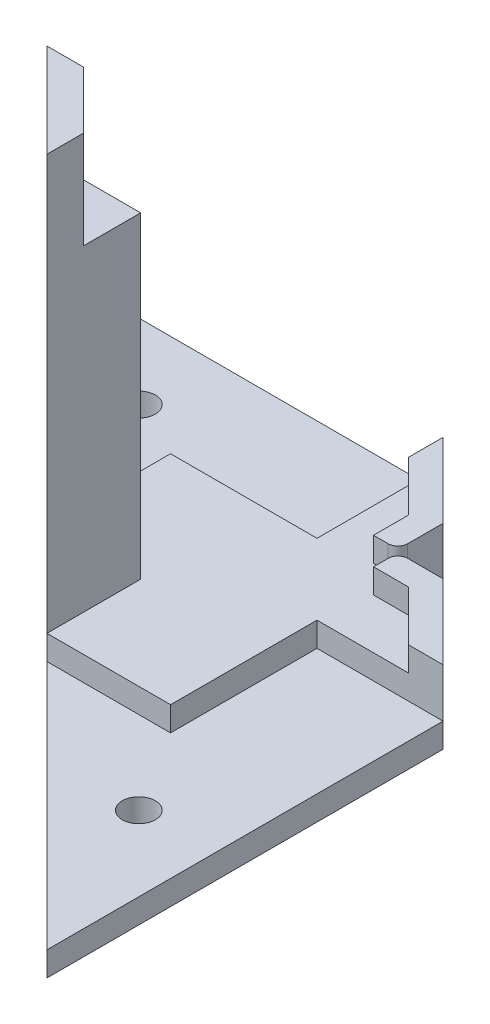
ISO-10303-21;
HEADER;
FILE_DESCRIPTION(('STEP AP214'),'2;1');
FILE_NAME('part.step','',(''),(''),'','','');
FILE_SCHEMA(('AUTOMOTIVE_DESIGN { 1 0 10303 214 1 1 1 1 }'));
ENDSEC;
DATA;
#1=APPLICATION_CONTEXT('core data for automotive mechanical design processes');
#2=APPLICATION_PROTOCOL_DEFINITION('international standard','automotive_design',2000,#1);
#3=PRODUCT_CONTEXT('',#1,'mechanical');
#4=PRODUCT('Part','Part','',(#3));
#5=PRODUCT_RELATED_PRODUCT_CATEGORY('part','',(#4));
#6=PRODUCT_DEFINITION_FORMATION('','',#4);
#7=PRODUCT_DEFINITION_CONTEXT('part definition',#1,'design');
#8=PRODUCT_DEFINITION('design','',#6,#7);
#9=PRODUCT_DEFINITION_SHAPE('','',#8);
#10=(LENGTH_UNIT() NAMED_UNIT(*) SI_UNIT(.MILLI.,.METRE.));
#11=(NAMED_UNIT(*) PLANE_ANGLE_UNIT() SI_UNIT($,.RADIAN.));
#12=(NAMED_UNIT(*) SI_UNIT($,.STERADIAN.) SOLID_ANGLE_UNIT());
#13=UNCERTAINTY_MEASURE_WITH_UNIT(LENGTH_MEASURE(1.E-05),#10,'distance_accuracy_value','');
#14=(GEOMETRIC_REPRESENTATION_CONTEXT(3) GLOBAL_UNCERTAINTY_ASSIGNED_CONTEXT((#13)) GLOBAL_UNIT_ASSIGNED_CONTEXT((#10,
#11,#12)) REPRESENTATION_CONTEXT('',''));
#15=CARTESIAN_POINT('',(0.,0.,0.));
#16=DIRECTION('',(0.,0.,1.));
#17=DIRECTION('',(1.,0.,0.));
#18=AXIS2_PLACEMENT_3D('',#15,#16,#17);
#19=CARTESIAN_POINT('',(0.,3.175,0.));
#20=DIRECTION('',(0.,1.,0.));
#21=DIRECTION('',(0.,0.,1.));
#22=AXIS2_PLACEMENT_3D('',#19,#20,#21);
#23=PLANE('',#22);
#24=DIRECTION('',(0.,0.,-1.));
#25=VECTOR('',#24,1.);
#26=CARTESIAN_POINT('',(0.,3.175,0.));
#27=LINE('',#26,#25);
#28=CARTESIAN_POINT('',(1.01518793371724E-13,3.175,-12.192));
#29=VERTEX_POINT('',#28);
#30=CARTESIAN_POINT('',(2.35416678444176E-13,3.175,-28.2725990751464));
#31=VERTEX_POINT('',#30);
#32=EDGE_CURVE('E434',#29,#31,#27,.T.);
#33=ORIENTED_EDGE('',*,*,#32,.F.);
#34=DIRECTION('',(-1.,0.,0.));
#35=VECTOR('',#34,1.);
#36=CARTESIAN_POINT('',(1.07298677462161E-13,3.175,-12.192));
#37=LINE('',#36,#35);
#38=CARTESIAN_POINT('',(12.192,3.175,-12.1919999999999));
#39=VERTEX_POINT('',#38);
#40=EDGE_CURVE('E316',#39,#29,#37,.T.);
#41=ORIENTED_EDGE('',*,*,#40,.F.);
#42=DIRECTION('',(0.,0.,1.));
#43=VECTOR('',#42,1.);
#44=CARTESIAN_POINT('',(12.192,3.175,0.));
#45=LINE('',#44,#43);
#46=CARTESIAN_POINT('',(12.192,3.175,0.));
#47=VERTEX_POINT('',#46);
#48=EDGE_CURVE('E363',#39,#47,#45,.T.);
#49=ORIENTED_EDGE('',*,*,#48,.T.);
#50=DIRECTION('',(1.,0.,0.));
#51=VECTOR('',#50,1.);
#52=CARTESIAN_POINT('',(0.,3.175,0.));
#53=LINE('',#52,#51);
#54=CARTESIAN_POINT('',(28.2725990751464,3.175,0.));
#55=VERTEX_POINT('',#54);
#56=EDGE_CURVE('E478',#47,#55,#53,.T.);
#57=ORIENTED_EDGE('',*,*,#56,.T.);
#58=DIRECTION('',(0.,0.,-1.));
#59=VECTOR('',#58,1.);
#60=CARTESIAN_POINT('',(28.2725990751464,3.175,-1.08131020282758E-13));
#61=LINE('',#60,#59);
#62=CARTESIAN_POINT('',(28.2725990751463,3.175,-19.05));
#63=VERTEX_POINT('',#62);
#64=EDGE_CURVE('E467',#55,#63,#61,.T.);
#65=ORIENTED_EDGE('',*,*,#64,.T.);
#66=DIRECTION('',(1.,0.,0.));
#67=VECTOR('',#66,1.);
#68=CARTESIAN_POINT('',(0.,3.175,-19.05));
#69=LINE('',#68,#67);
#70=CARTESIAN_POINT('',(40.1814765706117,3.175,-19.05));
#71=VERTEX_POINT('',#70);
#72=EDGE_CURVE('E471',#63,#71,#69,.T.);
#73=ORIENTED_EDGE('',*,*,#72,.T.);
#74=DIRECTION('',(0.707106781186558,0.,0.707106781186537));
#75=VECTOR('',#74,1.);
#76=CARTESIAN_POINT('',(33.6696569831903,3.175,-25.5618195874212));
#77=LINE('',#76,#75);
#78=CARTESIAN_POINT('',(33.6696569831903,3.175,-25.5618195874212));
#79=VERTEX_POINT('',#78);
#80=EDGE_CURVE('E411',#79,#71,#77,.T.);
#81=ORIENTED_EDGE('',*,*,#80,.F.);
#82=DIRECTION('',(1.,0.,0.));
#83=VECTOR('',#82,1.);
#84=CARTESIAN_POINT('',(29.1150201100372,3.175,-25.5618195874212));
#85=LINE('',#84,#83);
#86=CARTESIAN_POINT('',(29.1150201100372,3.175,-25.5618195874212));
#87=VERTEX_POINT('',#86);
#88=EDGE_CURVE('E389',#87,#79,#85,.T.);
#89=ORIENTED_EDGE('',*,*,#88,.F.);
#90=DIRECTION('',(0.,0.,-1.));
#91=VECTOR('',#90,1.);
#92=CARTESIAN_POINT('',(29.1150201100372,3.175,-25.5618195874212));
#93=LINE('',#92,#91);
#94=CARTESIAN_POINT('',(29.1150201100372,3.175,-27.4668195874212));
#95=VERTEX_POINT('',#94);
#96=EDGE_CURVE('E383',#87,#95,#93,.T.);
#97=ORIENTED_EDGE('',*,*,#96,.T.);
#98=CARTESIAN_POINT('',(30.3850201100372,3.175,-27.4668195874212));
#99=DIRECTION('',(0.,1.,0.));
#100=DIRECTION('',(0.,0.,1.));
#101=AXIS2_PLACEMENT_3D('',#98,#99,#100);
#102=CIRCLE('',#101,1.27);
#103=CARTESIAN_POINT('',(30.3850201100372,3.175,-28.7368195874212));
#104=VERTEX_POINT('',#103);
#105=EDGE_CURVE('E514',#95,#104,#102,.F.);
#106=ORIENTED_EDGE('',*,*,#105,.T.);
#107=DIRECTION('',(1.,0.,0.));
#108=VECTOR('',#107,1.);
#109=CARTESIAN_POINT('',(-4.62762683770787E-13,3.175,-28.7368195874207));
#110=LINE('',#109,#108);
#111=CARTESIAN_POINT('',(28.7368195874214,3.175,-28.7368195874212));
#112=VERTEX_POINT('',#111);
#113=EDGE_CURVE('E475',#112,#104,#110,.T.);
#114=ORIENTED_EDGE('',*,*,#113,.F.);
#115=DIRECTION('',(0.,0.,-1.));
#116=VECTOR('',#115,1.);
#117=CARTESIAN_POINT('',(28.7368195874207,3.175,7.11616058102325E-13));
#118=LINE('',#117,#116);
#119=CARTESIAN_POINT('',(28.7368195874214,3.175,-30.3850201100369));
#120=VERTEX_POINT('',#119);
#121=EDGE_CURVE('E237',#112,#120,#118,.T.);
#122=ORIENTED_EDGE('',*,*,#121,.T.);
#123=CARTESIAN_POINT('',(27.4668195874214,3.175,-30.385020110037));
#124=DIRECTION('',(0.,1.,0.));
#125=DIRECTION('',(0.,0.,1.));
#126=AXIS2_PLACEMENT_3D('',#123,#124,#125);
#127=CIRCLE('',#126,1.27);
#128=CARTESIAN_POINT('',(27.4668195874214,3.175,-29.115020110037));
#129=VERTEX_POINT('',#128);
#130=EDGE_CURVE('E52',#120,#129,#127,.F.);
#131=ORIENTED_EDGE('',*,*,#130,.T.);
#132=DIRECTION('',(1.,0.,0.));
#133=VECTOR('',#132,1.);
#134=CARTESIAN_POINT('',(25.5618195874214,3.175,-29.115020110037));
#135=LINE('',#134,#133);
#136=CARTESIAN_POINT('',(25.5618195874214,3.175,-29.115020110037));
#137=VERTEX_POINT('',#136);
#138=EDGE_CURVE('E327',#137,#129,#135,.T.);
#139=ORIENTED_EDGE('',*,*,#138,.F.);
#140=DIRECTION('',(0.,0.,-1.));
#141=VECTOR('',#140,1.);
#142=CARTESIAN_POINT('',(25.5618195874214,3.175,-29.115020110037));
#143=LINE('',#142,#141);
#144=CARTESIAN_POINT('',(25.5618195874215,3.175,-33.6696569831901));
#145=VERTEX_POINT('',#144);
#146=EDGE_CURVE('E353',#137,#145,#143,.T.);
#147=ORIENTED_EDGE('',*,*,#146,.T.);
#148=DIRECTION('',(-0.707106781186531,0.,-0.707106781186564));
#149=VECTOR('',#148,1.);
#150=CARTESIAN_POINT('',(25.5618195874215,3.175,-33.6696569831901));
#151=LINE('',#150,#149);
#152=CARTESIAN_POINT('',(19.0500000000003,3.175,-40.1814765706115));
#153=VERTEX_POINT('',#152);
#154=EDGE_CURVE('E332',#145,#153,#151,.T.);
#155=ORIENTED_EDGE('',*,*,#154,.T.);
#156=DIRECTION('',(0.,0.,-1.));
#157=VECTOR('',#156,1.);
#158=CARTESIAN_POINT('',(19.05,3.175,1.64968039229052E-13));
#159=LINE('',#158,#157);
#160=CARTESIAN_POINT('',(19.0500000000002,3.175,-28.2725990751462));
#161=VERTEX_POINT('',#160);
#162=EDGE_CURVE('E440',#161,#153,#159,.T.);
#163=ORIENTED_EDGE('',*,*,#162,.F.);
#164=DIRECTION('',(1.,0.,0.));
#165=VECTOR('',#164,1.);
#166=CARTESIAN_POINT('',(3.43547698726934E-13,3.175,-28.2725990751464));
#167=LINE('',#166,#165);
#168=EDGE_CURVE('E430',#31,#161,#167,.T.);
#169=ORIENTED_EDGE('',*,*,#168,.F.);
#170=EDGE_LOOP('',(#33,#41,#49,#57,#65,#73,#81,#89,#97,#106,#114,#122,#131,#139,#147,#155,#163,#169));
#171=FACE_BOUND('',#170,.T.);
#172=ADVANCED_FACE('F42',(#171),#23,.T.);
#173=CARTESIAN_POINT('',(28.2725990751464,3.175,-1.08131020282758E-13));
#174=DIRECTION('',(-1.,0.,0.));
#175=DIRECTION('',(0.,0.,1.));
#176=AXIS2_PLACEMENT_3D('',#173,#174,#175);
#177=PLANE('',#176);
#178=DIRECTION('',(0.,0.,-1.));
#179=VECTOR('',#178,1.);
#180=CARTESIAN_POINT('',(28.2725990751464,0.,-1.08131020282758E-13));
#181=LINE('',#180,#179);
#182=CARTESIAN_POINT('',(28.2725990751464,0.,0.));
#183=VERTEX_POINT('',#182);
#184=CARTESIAN_POINT('',(28.2725990751463,0.,-19.05));
#185=VERTEX_POINT('',#184);
#186=EDGE_CURVE('E466',#183,#185,#181,.T.);
#187=ORIENTED_EDGE('',*,*,#186,.T.);
#188=DIRECTION('',(0.,-1.,0.));
#189=VECTOR('',#188,1.);
#190=CARTESIAN_POINT('',(28.2725990751463,3.175,-19.05));
#191=LINE('',#190,#189);
#192=EDGE_CURVE('E500',#63,#185,#191,.T.);
#193=ORIENTED_EDGE('',*,*,#192,.F.);
#194=ORIENTED_EDGE('',*,*,#64,.F.);
#195=DIRECTION('',(0.,-1.,0.));
#196=VECTOR('',#195,1.);
#197=CARTESIAN_POINT('',(28.2725990751464,3.175,0.));
#198=LINE('',#197,#196);
#199=EDGE_CURVE('E242',#55,#183,#198,.T.);
#200=ORIENTED_EDGE('',*,*,#199,.T.);
#201=EDGE_LOOP('',(#187,#193,#194,#200));
#202=FACE_BOUND('',#201,.T.);
#203=ADVANCED_FACE('F568',(#202),#177,.F.);
#204=CARTESIAN_POINT('',(0.,3.175,-19.05));
#205=DIRECTION('',(0.,0.,-1.));
#206=DIRECTION('',(-1.,0.,0.));
#207=AXIS2_PLACEMENT_3D('',#204,#205,#206);
#208=PLANE('',#207);
#209=DIRECTION('',(1.,0.,0.));
#210=VECTOR('',#209,1.);
#211=CARTESIAN_POINT('',(0.,0.,-19.05));
#212=LINE('',#211,#210);
#213=CARTESIAN_POINT('',(44.6716046311463,0.,-19.05));
#214=VERTEX_POINT('',#213);
#215=EDGE_CURVE('E484',#185,#214,#212,.T.);
#216=ORIENTED_EDGE('',*,*,#215,.T.);
#217=DIRECTION('',(0.,-1.,0.));
#218=VECTOR('',#217,1.);
#219=CARTESIAN_POINT('',(44.6716046311463,3.175,-19.05));
#220=LINE('',#219,#218);
#221=CARTESIAN_POINT('',(44.6716046311463,6.35,-19.05));
#222=VERTEX_POINT('',#221);
#223=EDGE_CURVE('E496',#222,#214,#220,.T.);
#224=ORIENTED_EDGE('',*,*,#223,.F.);
#225=DIRECTION('',(-1.,0.,0.));
#226=VECTOR('',#225,1.);
#227=CARTESIAN_POINT('',(44.6716046311463,6.35,-19.05));
#228=LINE('',#227,#226);
#229=CARTESIAN_POINT('',(40.1814765706117,6.35,-19.05));
#230=VERTEX_POINT('',#229);
#231=EDGE_CURVE('E397',#222,#230,#228,.T.);
#232=ORIENTED_EDGE('',*,*,#231,.T.);
#233=DIRECTION('',(0.,-1.,0.));
#234=VECTOR('',#233,1.);
#235=CARTESIAN_POINT('',(40.1814765706117,6.35,-19.05));
#236=LINE('',#235,#234);
#237=EDGE_CURVE('E407',#230,#71,#236,.T.);
#238=ORIENTED_EDGE('',*,*,#237,.T.);
#239=ORIENTED_EDGE('',*,*,#72,.F.);
#240=ORIENTED_EDGE('',*,*,#192,.T.);
#241=EDGE_LOOP('',(#216,#224,#232,#238,#239,#240));
#242=FACE_BOUND('',#241,.T.);
#243=ADVANCED_FACE('F571',(#242),#208,.F.);
#244=CARTESIAN_POINT('',(31.8608023155725,3.175,-31.8608023155735));
#245=DIRECTION('',(0.707106781186537,0.,-0.707106781186558));
#246=DIRECTION('',(-0.707106781186558,0.,-0.707106781186537));
#247=AXIS2_PLACEMENT_3D('',#244,#245,#246);
#248=PLANE('',#247);
#249=ORIENTED_EDGE('',*,*,#223,.T.);
#250=DIRECTION('',(0.,1.,0.));
#251=VECTOR('',#250,1.);
#252=CARTESIAN_POINT('',(44.6716046311463,-3.175,-19.05));
#253=LINE('',#252,#251);
#254=CARTESIAN_POINT('',(44.6716046311463,-3.175,-19.05));
#255=VERTEX_POINT('',#254);
#256=EDGE_CURVE('E275',#255,#214,#253,.T.);
#257=ORIENTED_EDGE('',*,*,#256,.F.);
#258=DIRECTION('',(-0.707106781186558,0.,-0.707106781186537));
#259=VECTOR('',#258,1.);
#260=CARTESIAN_POINT('',(34.9847850437248,-3.175,-28.7368195874213));
#261=LINE('',#260,#259);
#262=CARTESIAN_POINT('',(34.9847850437248,-3.175,-28.7368195874213));
#263=VERTEX_POINT('',#262);
#264=EDGE_CURVE('E252',#255,#263,#261,.T.);
#265=ORIENTED_EDGE('',*,*,#264,.T.);
#266=DIRECTION('',(0.,-1.,0.));
#267=VECTOR('',#266,1.);
#268=CARTESIAN_POINT('',(34.9847850437248,3.175,-28.7368195874213));
#269=LINE('',#268,#267);
#270=CARTESIAN_POINT('',(34.9847850437249,6.35,-28.7368195874212));
#271=VERTEX_POINT('',#270);
#272=EDGE_CURVE('E241',#271,#263,#269,.T.);
#273=ORIENTED_EDGE('',*,*,#272,.F.);
#274=DIRECTION('',(0.707106781186558,0.,0.707106781186537));
#275=VECTOR('',#274,1.);
#276=CARTESIAN_POINT('',(34.9847850437249,6.35,-28.7368195874212));
#277=LINE('',#276,#275);
#278=EDGE_CURVE('E393',#271,#222,#277,.T.);
#279=ORIENTED_EDGE('',*,*,#278,.T.);
#280=EDGE_LOOP('',(#249,#257,#265,#273,#279));
#281=FACE_BOUND('',#280,.T.);
#282=ADVANCED_FACE('F592',(#281),#248,.T.);
#283=CARTESIAN_POINT('',(-4.62762683770787E-13,3.175,-28.7368195874207));
#284=DIRECTION('',(0.,0.,-1.));
#285=DIRECTION('',(-1.,0.,0.));
#286=AXIS2_PLACEMENT_3D('',#283,#284,#285);
#287=PLANE('',#286);
#288=ORIENTED_EDGE('',*,*,#113,.T.);
#289=DIRECTION('',(0.,-1.,0.));
#290=VECTOR('',#289,1.);
#291=CARTESIAN_POINT('',(30.3850201100372,3.175,-28.7368195874212));
#292=LINE('',#291,#290);
#293=CARTESIAN_POINT('',(30.3850201100372,6.35,-28.7368195874212));
#294=VERTEX_POINT('',#293);
#295=EDGE_CURVE('E508',#104,#294,#292,.F.);
#296=ORIENTED_EDGE('',*,*,#295,.T.);
#297=DIRECTION('',(-1.,0.,0.));
#298=VECTOR('',#297,1.);
#299=CARTESIAN_POINT('',(34.9847850437249,6.35,-28.7368195874212));
#300=LINE('',#299,#298);
#301=EDGE_CURVE('E388',#271,#294,#300,.T.);
#302=ORIENTED_EDGE('',*,*,#301,.F.);
#303=ORIENTED_EDGE('',*,*,#272,.T.);
#304=DIRECTION('',(-1.,0.,0.));
#305=VECTOR('',#304,1.);
#306=CARTESIAN_POINT('',(28.7368195874214,-3.175,-28.7368195874212));
#307=LINE('',#306,#305);
#308=CARTESIAN_POINT('',(28.7368195874214,-3.175,-28.7368195874212));
#309=VERTEX_POINT('',#308);
#310=EDGE_CURVE('E245',#263,#309,#307,.T.);
#311=ORIENTED_EDGE('',*,*,#310,.T.);
#312=DIRECTION('',(0.,-1.,0.));
#313=VECTOR('',#312,1.);
#314=CARTESIAN_POINT('',(28.7368195874214,3.175,-28.7368195874212));
#315=LINE('',#314,#313);
#316=EDGE_CURVE('E230',#112,#309,#315,.T.);
#317=ORIENTED_EDGE('',*,*,#316,.F.);
#318=EDGE_LOOP('',(#288,#296,#302,#303,#311,#317));
#319=FACE_BOUND('',#318,.T.);
#320=ADVANCED_FACE('F246',(#319),#287,.T.);
#321=CARTESIAN_POINT('',(0.,3.175,0.));
#322=DIRECTION('',(0.,0.,-1.));
#323=DIRECTION('',(-1.,0.,0.));
#324=AXIS2_PLACEMENT_3D('',#321,#322,#323);
#325=PLANE('',#324);
#326=ORIENTED_EDGE('',*,*,#56,.F.);
#327=DIRECTION('',(0.,1.,0.));
#328=VECTOR('',#327,1.);
#329=CARTESIAN_POINT('',(12.192,-6.35,0.));
#330=LINE('',#329,#328);
#331=CARTESIAN_POINT('',(12.192,0.,0.));
#332=VERTEX_POINT('',#331);
#333=EDGE_CURVE('E283',#332,#47,#330,.T.);
#334=ORIENTED_EDGE('',*,*,#333,.F.);
#335=DIRECTION('',(1.,0.,0.));
#336=VECTOR('',#335,1.);
#337=CARTESIAN_POINT('',(0.,0.,0.));
#338=LINE('',#337,#336);
#339=EDGE_CURVE('E472',#332,#183,#338,.T.);
#340=ORIENTED_EDGE('',*,*,#339,.T.);
#341=ORIENTED_EDGE('',*,*,#199,.F.);
#342=EDGE_LOOP('',(#326,#334,#340,#341));
#343=FACE_BOUND('',#342,.T.);
#344=ADVANCED_FACE('F564',(#343),#325,.F.);
#345=CARTESIAN_POINT('',(3.43547698726934E-13,3.175,-28.2725990751464));
#346=DIRECTION('',(0.,0.,-1.));
#347=DIRECTION('',(-1.,0.,0.));
#348=AXIS2_PLACEMENT_3D('',#345,#346,#347);
#349=PLANE('',#348);
#350=DIRECTION('',(1.,0.,0.));
#351=VECTOR('',#350,1.);
#352=CARTESIAN_POINT('',(3.43547698726934E-13,0.,-28.2725990751464));
#353=LINE('',#352,#351);
#354=CARTESIAN_POINT('',(2.35416678444176E-13,0.,-28.2725990751464));
#355=VERTEX_POINT('',#354);
#356=CARTESIAN_POINT('',(19.0500000000002,0.,-28.2725990751462));
#357=VERTEX_POINT('',#356);
#358=EDGE_CURVE('E422',#355,#357,#353,.T.);
#359=ORIENTED_EDGE('',*,*,#358,.F.);
#360=DIRECTION('',(0.,-1.,0.));
#361=VECTOR('',#360,1.);
#362=CARTESIAN_POINT('',(2.35416678444176E-13,3.175,-28.2725990751464));
#363=LINE('',#362,#361);
#364=EDGE_CURVE('E463',#31,#355,#363,.T.);
#365=ORIENTED_EDGE('',*,*,#364,.F.);
#366=ORIENTED_EDGE('',*,*,#168,.T.);
#367=DIRECTION('',(0.,-1.,0.));
#368=VECTOR('',#367,1.);
#369=CARTESIAN_POINT('',(19.0500000000002,3.175,-28.2725990751462));
#370=LINE('',#369,#368);
#371=EDGE_CURVE('E444',#161,#357,#370,.T.);
#372=ORIENTED_EDGE('',*,*,#371,.T.);
#373=EDGE_LOOP('',(#359,#365,#366,#372));
#374=FACE_BOUND('',#373,.T.);
#375=ADVANCED_FACE('F649',(#374),#349,.T.);
#376=CARTESIAN_POINT('',(0.,3.175,0.));
#377=DIRECTION('',(-1.,0.,0.));
#378=DIRECTION('',(0.,0.,1.));
#379=AXIS2_PLACEMENT_3D('',#376,#377,#378);
#380=PLANE('',#379);
#381=DIRECTION('',(0.,-1.,0.));
#382=VECTOR('',#381,1.);
#383=CARTESIAN_POINT('',(1.01518793371724E-13,3.175,-12.192));
#384=LINE('',#383,#382);
#385=CARTESIAN_POINT('',(1.01518793371724E-13,0.,-12.192));
#386=VERTEX_POINT('',#385);
#387=EDGE_CURVE('E11',#29,#386,#384,.T.);
#388=ORIENTED_EDGE('',*,*,#387,.F.);
#389=ORIENTED_EDGE('',*,*,#32,.T.);
#390=ORIENTED_EDGE('',*,*,#364,.T.);
#391=DIRECTION('',(0.,0.,-1.));
#392=VECTOR('',#391,1.);
#393=CARTESIAN_POINT('',(0.,0.,0.));
#394=LINE('',#393,#392);
#395=EDGE_CURVE('E448',#386,#355,#394,.T.);
#396=ORIENTED_EDGE('',*,*,#395,.F.);
#397=EDGE_LOOP('',(#388,#389,#390,#396));
#398=FACE_BOUND('',#397,.T.);
#399=ADVANCED_FACE('F651',(#398),#380,.T.);
#400=CARTESIAN_POINT('',(28.7368195874207,3.175,7.11616058102325E-13));
#401=DIRECTION('',(-1.,0.,0.));
#402=DIRECTION('',(0.,0.,1.));
#403=AXIS2_PLACEMENT_3D('',#400,#401,#402);
#404=PLANE('',#403);
#405=DIRECTION('',(0.,0.,1.));
#406=VECTOR('',#405,1.);
#407=CARTESIAN_POINT('',(28.7368195874215,6.35,-34.9847850437246));
#408=LINE('',#407,#406);
#409=CARTESIAN_POINT('',(28.7368195874215,6.35,-34.9847850437246));
#410=VERTEX_POINT('',#409);
#411=CARTESIAN_POINT('',(28.7368195874214,6.35,-30.3850201100369));
#412=VERTEX_POINT('',#411);
#413=EDGE_CURVE('E347',#410,#412,#408,.T.);
#414=ORIENTED_EDGE('',*,*,#413,.T.);
#415=DIRECTION('',(0.,-1.,0.));
#416=VECTOR('',#415,1.);
#417=CARTESIAN_POINT('',(28.7368195874214,3.175,-30.3850201100369));
#418=LINE('',#417,#416);
#419=EDGE_CURVE('E518',#412,#120,#418,.T.);
#420=ORIENTED_EDGE('',*,*,#419,.T.);
#421=ORIENTED_EDGE('',*,*,#121,.F.);
#422=ORIENTED_EDGE('',*,*,#316,.T.);
#423=DIRECTION('',(0.,0.,1.));
#424=VECTOR('',#423,1.);
#425=CARTESIAN_POINT('',(28.7368195874214,-3.175,-28.7368195874212));
#426=LINE('',#425,#424);
#427=CARTESIAN_POINT('',(28.7368195874216,-3.175,-34.9847850437245));
#428=VERTEX_POINT('',#427);
#429=EDGE_CURVE('E235',#428,#309,#426,.T.);
#430=ORIENTED_EDGE('',*,*,#429,.F.);
#431=DIRECTION('',(0.,-1.,0.));
#432=VECTOR('',#431,1.);
#433=CARTESIAN_POINT('',(28.7368195874216,3.175,-34.9847850437245));
#434=LINE('',#433,#432);
#435=EDGE_CURVE('E460',#410,#428,#434,.T.);
#436=ORIENTED_EDGE('',*,*,#435,.F.);
#437=EDGE_LOOP('',(#414,#420,#421,#422,#430,#436));
#438=FACE_BOUND('',#437,.T.);
#439=ADVANCED_FACE('F233',(#438),#404,.F.);
#440=CARTESIAN_POINT('',(31.8608023155737,3.175,-31.8608023155722));
#441=DIRECTION('',(-0.707106781186564,0.,0.707106781186531));
#442=DIRECTION('',(0.707106781186531,0.,0.707106781186564));
#443=AXIS2_PLACEMENT_3D('',#440,#441,#442);
#444=PLANE('',#443);
#445=ORIENTED_EDGE('',*,*,#435,.T.);
#446=DIRECTION('',(0.707106781186531,0.,0.707106781186564));
#447=VECTOR('',#446,1.);
#448=CARTESIAN_POINT('',(28.7368195874216,-3.175,-34.9847850437245));
#449=LINE('',#448,#447);
#450=CARTESIAN_POINT('',(19.0500000000004,-3.175,-44.6716046311462));
#451=VERTEX_POINT('',#450);
#452=EDGE_CURVE('E258',#451,#428,#449,.T.);
#453=ORIENTED_EDGE('',*,*,#452,.F.);
#454=DIRECTION('',(0.,1.,0.));
#455=VECTOR('',#454,1.);
#456=CARTESIAN_POINT('',(19.0500000000004,-3.175,-44.6716046311462));
#457=LINE('',#456,#455);
#458=CARTESIAN_POINT('',(19.0500000000004,0.,-44.6716046311462));
#459=VERTEX_POINT('',#458);
#460=EDGE_CURVE('E260',#451,#459,#457,.T.);
#461=ORIENTED_EDGE('',*,*,#460,.T.);
#462=DIRECTION('',(0.,-1.,0.));
#463=VECTOR('',#462,1.);
#464=CARTESIAN_POINT('',(19.0500000000004,3.175,-44.6716046311462));
#465=LINE('',#464,#463);
#466=CARTESIAN_POINT('',(19.0500000000004,6.35,-44.6716046311462));
#467=VERTEX_POINT('',#466);
#468=EDGE_CURVE('E457',#467,#459,#465,.T.);
#469=ORIENTED_EDGE('',*,*,#468,.F.);
#470=DIRECTION('',(-0.707106781186531,0.,-0.707106781186564));
#471=VECTOR('',#470,1.);
#472=CARTESIAN_POINT('',(28.7368195874215,6.35,-34.9847850437246));
#473=LINE('',#472,#471);
#474=EDGE_CURVE('E343',#410,#467,#473,.T.);
#475=ORIENTED_EDGE('',*,*,#474,.F.);
#476=EDGE_LOOP('',(#445,#453,#461,#469,#475));
#477=FACE_BOUND('',#476,.T.);
#478=ADVANCED_FACE('F623',(#477),#444,.F.);
#479=CARTESIAN_POINT('',(19.05,3.175,1.64968039229052E-13));
#480=DIRECTION('',(-1.,0.,0.));
#481=DIRECTION('',(0.,0.,1.));
#482=AXIS2_PLACEMENT_3D('',#479,#480,#481);
#483=PLANE('',#482);
#484=DIRECTION('',(0.,0.,-1.));
#485=VECTOR('',#484,1.);
#486=CARTESIAN_POINT('',(19.05,0.,1.64968039229052E-13));
#487=LINE('',#486,#485);
#488=EDGE_CURVE('E435',#357,#459,#487,.T.);
#489=ORIENTED_EDGE('',*,*,#488,.F.);
#490=ORIENTED_EDGE('',*,*,#371,.F.);
#491=ORIENTED_EDGE('',*,*,#162,.T.);
#492=DIRECTION('',(0.,-1.,0.));
#493=VECTOR('',#492,1.);
#494=CARTESIAN_POINT('',(19.0500000000003,6.35,-40.1814765706115));
#495=LINE('',#494,#493);
#496=CARTESIAN_POINT('',(19.0500000000003,6.35,-40.1814765706115));
#497=VERTEX_POINT('',#496);
#498=EDGE_CURVE('E360',#497,#153,#495,.T.);
#499=ORIENTED_EDGE('',*,*,#498,.F.);
#500=DIRECTION('',(0.,0.,1.));
#501=VECTOR('',#500,1.);
#502=CARTESIAN_POINT('',(19.0500000000004,6.35,-44.6716046311462));
#503=LINE('',#502,#501);
#504=EDGE_CURVE('E340',#467,#497,#503,.T.);
#505=ORIENTED_EDGE('',*,*,#504,.F.);
#506=ORIENTED_EDGE('',*,*,#468,.T.);
#507=EDGE_LOOP('',(#489,#490,#491,#499,#505,#506));
#508=FACE_BOUND('',#507,.T.);
#509=ADVANCED_FACE('F644',(#508),#483,.T.);
#510=CARTESIAN_POINT('',(29.1150201100372,6.35,-25.5618195874212));
#511=DIRECTION('',(-1.,0.,0.));
#512=DIRECTION('',(0.,0.,1.));
#513=AXIS2_PLACEMENT_3D('',#510,#511,#512);
#514=PLANE('',#513);
#515=DIRECTION('',(0.,0.,-1.));
#516=VECTOR('',#515,1.);
#517=CARTESIAN_POINT('',(29.1150201100372,6.35,-25.5618195874212));
#518=LINE('',#517,#516);
#519=CARTESIAN_POINT('',(29.1150201100372,6.35,-25.5618195874212));
#520=VERTEX_POINT('',#519);
#521=CARTESIAN_POINT('',(29.1150201100372,6.35,-27.4668195874212));
#522=VERTEX_POINT('',#521);
#523=EDGE_CURVE('E384',#520,#522,#518,.T.);
#524=ORIENTED_EDGE('',*,*,#523,.T.);
#525=DIRECTION('',(0.,-1.,0.));
#526=VECTOR('',#525,1.);
#527=CARTESIAN_POINT('',(29.1150201100372,6.35,-27.4668195874212));
#528=LINE('',#527,#526);
#529=EDGE_CURVE('E504',#522,#95,#528,.T.);
#530=ORIENTED_EDGE('',*,*,#529,.T.);
#531=ORIENTED_EDGE('',*,*,#96,.F.);
#532=DIRECTION('',(0.,-1.,0.));
#533=VECTOR('',#532,1.);
#534=CARTESIAN_POINT('',(29.1150201100372,6.35,-25.5618195874212));
#535=LINE('',#534,#533);
#536=EDGE_CURVE('E418',#520,#87,#535,.T.);
#537=ORIENTED_EDGE('',*,*,#536,.F.);
#538=EDGE_LOOP('',(#524,#530,#531,#537));
#539=FACE_BOUND('',#538,.T.);
#540=ADVANCED_FACE('F584',(#539),#514,.T.);
#541=CARTESIAN_POINT('',(29.1150201100372,6.35,-25.5618195874212));
#542=DIRECTION('',(0.,0.,-1.));
#543=DIRECTION('',(-1.,0.,0.));
#544=AXIS2_PLACEMENT_3D('',#541,#542,#543);
#545=PLANE('',#544);
#546=ORIENTED_EDGE('',*,*,#88,.T.);
#547=DIRECTION('',(0.,-1.,0.));
#548=VECTOR('',#547,1.);
#549=CARTESIAN_POINT('',(33.6696569831903,6.35,-25.5618195874212));
#550=LINE('',#549,#548);
#551=CARTESIAN_POINT('',(33.6696569831903,6.35,-25.5618195874212));
#552=VERTEX_POINT('',#551);
#553=EDGE_CURVE('E423',#552,#79,#550,.T.);
#554=ORIENTED_EDGE('',*,*,#553,.F.);
#555=DIRECTION('',(1.,0.,0.));
#556=VECTOR('',#555,1.);
#557=CARTESIAN_POINT('',(29.1150201100372,6.35,-25.5618195874212));
#558=LINE('',#557,#556);
#559=EDGE_CURVE('E404',#520,#552,#558,.T.);
#560=ORIENTED_EDGE('',*,*,#559,.F.);
#561=ORIENTED_EDGE('',*,*,#536,.T.);
#562=EDGE_LOOP('',(#546,#554,#560,#561));
#563=FACE_BOUND('',#562,.T.);
#564=ADVANCED_FACE('F579',(#563),#545,.F.);
#565=CARTESIAN_POINT('',(33.6696569831903,6.35,-25.5618195874212));
#566=DIRECTION('',(0.707106781186537,0.,-0.707106781186558));
#567=DIRECTION('',(-0.707106781186558,0.,-0.707106781186537));
#568=AXIS2_PLACEMENT_3D('',#565,#566,#567);
#569=PLANE('',#568);
#570=ORIENTED_EDGE('',*,*,#80,.T.);
#571=ORIENTED_EDGE('',*,*,#237,.F.);
#572=DIRECTION('',(0.707106781186558,0.,0.707106781186537));
#573=VECTOR('',#572,1.);
#574=CARTESIAN_POINT('',(33.6696569831903,6.35,-25.5618195874212));
#575=LINE('',#574,#573);
#576=EDGE_CURVE('E401',#552,#230,#575,.T.);
#577=ORIENTED_EDGE('',*,*,#576,.F.);
#578=ORIENTED_EDGE('',*,*,#553,.T.);
#579=EDGE_LOOP('',(#570,#571,#577,#578));
#580=FACE_BOUND('',#579,.T.);
#581=ADVANCED_FACE('F575',(#580),#569,.F.);
#582=CARTESIAN_POINT('',(0.,6.35,0.));
#583=DIRECTION('',(0.,1.,0.));
#584=DIRECTION('',(0.,0.,1.));
#585=AXIS2_PLACEMENT_3D('',#582,#583,#584);
#586=PLANE('',#585);
#587=ORIENTED_EDGE('',*,*,#301,.T.);
#588=CARTESIAN_POINT('',(30.3850201100372,6.35,-27.4668195874212));
#589=DIRECTION('',(0.,1.,0.));
#590=DIRECTION('',(0.,0.,1.));
#591=AXIS2_PLACEMENT_3D('',#588,#589,#590);
#592=CIRCLE('',#591,1.27);
#593=EDGE_CURVE('E511',#294,#522,#592,.T.);
#594=ORIENTED_EDGE('',*,*,#593,.T.);
#595=ORIENTED_EDGE('',*,*,#523,.F.);
#596=ORIENTED_EDGE('',*,*,#559,.T.);
#597=ORIENTED_EDGE('',*,*,#576,.T.);
#598=ORIENTED_EDGE('',*,*,#231,.F.);
#599=ORIENTED_EDGE('',*,*,#278,.F.);
#600=EDGE_LOOP('',(#587,#594,#595,#596,#597,#598,#599));
#601=FACE_BOUND('',#600,.T.);
#602=ADVANCED_FACE('F590',(#601),#586,.T.);
#603=CARTESIAN_POINT('',(30.3850201100372,6.35,-27.4668195874212));
#604=DIRECTION('',(0.,-1.,0.));
#605=DIRECTION('',(0.,0.,-1.));
#606=AXIS2_PLACEMENT_3D('',#603,#604,#605);
#607=CYLINDRICAL_SURFACE('',#606,1.27);
#608=ORIENTED_EDGE('',*,*,#593,.F.);
#609=ORIENTED_EDGE('',*,*,#295,.F.);
#610=ORIENTED_EDGE('',*,*,#105,.F.);
#611=ORIENTED_EDGE('',*,*,#529,.F.);
#612=EDGE_LOOP('',(#608,#609,#610,#611));
#613=FACE_BOUND('',#612,.T.);
#614=ADVANCED_FACE('F539',(#613),#607,.T.);
#615=CARTESIAN_POINT('',(6.096,44.45,-6.096));
#616=DIRECTION('',(-0.707106781186548,0.,0.707106781186548));
#617=DIRECTION('',(0.707106781186548,0.,0.707106781186548));
#618=AXIS2_PLACEMENT_3D('',#615,#616,#617);
#619=PLANE('',#618);
#620=CARTESIAN_POINT('',(6.09600000000002,52.3875,-6.09599999999998));
#621=DIRECTION('',(-0.707106781186548,0.,0.707106781186548));
#622=DIRECTION('',(0.707106781186548,0.,0.707106781186548));
#623=AXIS2_PLACEMENT_3D('',#620,#621,#622);
#624=CIRCLE('',#623,2.15265);
#625=CARTESIAN_POINT('',(7.61815341252124,52.3875,-4.57384658747876));
#626=VERTEX_POINT('',#625);
#627=EDGE_CURVE('E290',#626,#626,#624,.T.);
#628=ORIENTED_EDGE('',*,*,#627,.F.);
#629=EDGE_LOOP('',(#628));
#630=FACE_BOUND('',#629,.T.);
#631=DIRECTION('',(0.,-1.,0.));
#632=VECTOR('',#631,1.);
#633=CARTESIAN_POINT('',(1.05361269420869E-13,44.45,-12.192));
#634=LINE('',#633,#632);
#635=CARTESIAN_POINT('',(1.05361269420869E-13,57.15,-12.192));
#636=VERTEX_POINT('',#635);
#637=EDGE_CURVE('E320',#636,#29,#634,.T.);
#638=ORIENTED_EDGE('',*,*,#637,.T.);
#639=ORIENTED_EDGE('',*,*,#387,.T.);
#640=DIRECTION('',(-0.707106781186548,0.,-0.707106781186548));
#641=VECTOR('',#640,1.);
#642=CARTESIAN_POINT('',(6.0960000000001,0.,-6.09600000000009));
#643=LINE('',#642,#641);
#644=CARTESIAN_POINT('',(-32.479604631146,0.,-44.6716046311462));
#645=VERTEX_POINT('',#644);
#646=EDGE_CURVE('E271',#386,#645,#643,.T.);
#647=ORIENTED_EDGE('',*,*,#646,.T.);
#648=DIRECTION('',(0.,1.,0.));
#649=VECTOR('',#648,1.);
#650=CARTESIAN_POINT('',(-32.479604631146,-3.175,-44.6716046311462));
#651=LINE('',#650,#649);
#652=CARTESIAN_POINT('',(-32.479604631146,-3.175,-44.6716046311462));
#653=VERTEX_POINT('',#652);
#654=EDGE_CURVE('E265',#653,#645,#651,.T.);
#655=ORIENTED_EDGE('',*,*,#654,.F.);
#656=DIRECTION('',(-0.707106781186548,0.,-0.707106781186548));
#657=VECTOR('',#656,1.);
#658=CARTESIAN_POINT('',(6.0960000000001,-3.175,-6.09600000000009));
#659=LINE('',#658,#657);
#660=CARTESIAN_POINT('',(44.6716046311459,-3.175,32.4796046311464));
#661=VERTEX_POINT('',#660);
#662=EDGE_CURVE('E278',#661,#653,#659,.T.);
#663=ORIENTED_EDGE('',*,*,#662,.F.);
#664=DIRECTION('',(0.,1.,0.));
#665=VECTOR('',#664,1.);
#666=CARTESIAN_POINT('',(44.6716046311459,-3.175,32.4796046311464));
#667=LINE('',#666,#665);
#668=CARTESIAN_POINT('',(44.6716046311459,0.,32.4796046311464));
#669=VERTEX_POINT('',#668);
#670=EDGE_CURVE('E599',#661,#669,#667,.T.);
#671=ORIENTED_EDGE('',*,*,#670,.T.);
#672=DIRECTION('',(0.707106781186541,0.,0.707106781186554));
#673=VECTOR('',#672,1.);
#674=CARTESIAN_POINT('',(6.09600000000014,0.,-6.09600000000005));
#675=LINE('',#674,#673);
#676=EDGE_CURVE('E253',#332,#669,#675,.T.);
#677=ORIENTED_EDGE('',*,*,#676,.F.);
#678=ORIENTED_EDGE('',*,*,#333,.T.);
#679=DIRECTION('',(0.,-1.,0.));
#680=VECTOR('',#679,1.);
#681=CARTESIAN_POINT('',(12.192,44.45,0.));
#682=LINE('',#681,#680);
#683=CARTESIAN_POINT('',(12.192,57.15,0.));
#684=VERTEX_POINT('',#683);
#685=EDGE_CURVE('E379',#684,#47,#682,.T.);
#686=ORIENTED_EDGE('',*,*,#685,.F.);
#687=DIRECTION('',(0.707106781186544,0.,0.707106781186551));
#688=VECTOR('',#687,1.);
#689=CARTESIAN_POINT('',(12.192,57.15,0.));
#690=LINE('',#689,#688);
#691=EDGE_CURVE('E302',#636,#684,#690,.T.);
#692=ORIENTED_EDGE('',*,*,#691,.F.);
#693=EDGE_LOOP('',(#638,#639,#647,#655,#663,#671,#677,#678,#686,#692));
#694=FACE_BOUND('',#693,.T.);
#695=ADVANCED_FACE('F535',(#630,#694),#619,.T.);
#696=CARTESIAN_POINT('',(12.192,44.45,0.));
#697=DIRECTION('',(1.,0.,0.));
#698=DIRECTION('',(0.,0.,-1.));
#699=AXIS2_PLACEMENT_3D('',#696,#697,#698);
#700=PLANE('',#699);
#701=ORIENTED_EDGE('',*,*,#48,.F.);
#702=DIRECTION('',(0.,-1.,0.));
#703=VECTOR('',#702,1.);
#704=CARTESIAN_POINT('',(12.192,44.45,-12.1919999999999));
#705=LINE('',#704,#703);
#706=CARTESIAN_POINT('',(12.192,44.45,-12.1919999999999));
#707=VERTEX_POINT('',#706);
#708=EDGE_CURVE('E372',#707,#39,#705,.T.);
#709=ORIENTED_EDGE('',*,*,#708,.F.);
#710=DIRECTION('',(0.,0.,1.));
#711=VECTOR('',#710,1.);
#712=CARTESIAN_POINT('',(12.192,44.45,0.));
#713=LINE('',#712,#711);
#714=CARTESIAN_POINT('',(12.192,44.45,-4.76249999999994));
#715=VERTEX_POINT('',#714);
#716=EDGE_CURVE('E369',#707,#715,#713,.T.);
#717=ORIENTED_EDGE('',*,*,#716,.T.);
#718=DIRECTION('',(0.,-1.,0.));
#719=VECTOR('',#718,1.);
#720=CARTESIAN_POINT('',(12.192,57.15,-4.76249999999994));
#721=LINE('',#720,#719);
#722=CARTESIAN_POINT('',(12.192,57.15,-4.76249999999994));
#723=VERTEX_POINT('',#722);
#724=EDGE_CURVE('E312',#723,#715,#721,.T.);
#725=ORIENTED_EDGE('',*,*,#724,.F.);
#726=DIRECTION('',(0.,0.,-1.));
#727=VECTOR('',#726,1.);
#728=CARTESIAN_POINT('',(12.192,57.15,-4.76249999999994));
#729=LINE('',#728,#727);
#730=EDGE_CURVE('E291',#684,#723,#729,.T.);
#731=ORIENTED_EDGE('',*,*,#730,.F.);
#732=ORIENTED_EDGE('',*,*,#685,.T.);
#733=EDGE_LOOP('',(#701,#709,#717,#725,#731,#732));
#734=FACE_BOUND('',#733,.T.);
#735=ADVANCED_FACE('F538',(#734),#700,.T.);
#736=CARTESIAN_POINT('',(0.,44.45,0.));
#737=DIRECTION('',(0.,1.,0.));
#738=DIRECTION('',(0.,0.,1.));
#739=AXIS2_PLACEMENT_3D('',#736,#737,#738);
#740=PLANE('',#739);
#741=DIRECTION('',(-0.707106781186545,0.,-0.70710678118655));
#742=VECTOR('',#741,1.);
#743=CARTESIAN_POINT('',(4.7625000000001,44.45,-12.1919999999999));
#744=LINE('',#743,#742);
#745=CARTESIAN_POINT('',(4.7625000000001,44.45,-12.1919999999999));
#746=VERTEX_POINT('',#745);
#747=EDGE_CURVE('E59',#715,#746,#744,.T.);
#748=ORIENTED_EDGE('',*,*,#747,.F.);
#749=ORIENTED_EDGE('',*,*,#716,.F.);
#750=DIRECTION('',(-1.,0.,0.));
#751=VECTOR('',#750,1.);
#752=CARTESIAN_POINT('',(1.07095992896846E-13,44.45,-12.192));
#753=LINE('',#752,#751);
#754=EDGE_CURVE('E317',#707,#746,#753,.T.);
#755=ORIENTED_EDGE('',*,*,#754,.T.);
#756=EDGE_LOOP('',(#748,#749,#755));
#757=FACE_BOUND('',#756,.T.);
#758=ADVANCED_FACE('F555',(#757),#740,.T.);
#759=CARTESIAN_POINT('',(25.5618195874214,6.35,-29.115020110037));
#760=DIRECTION('',(0.,0.,-1.));
#761=DIRECTION('',(-1.,0.,0.));
#762=AXIS2_PLACEMENT_3D('',#759,#760,#761);
#763=PLANE('',#762);
#764=ORIENTED_EDGE('',*,*,#138,.T.);
#765=DIRECTION('',(0.,-1.,0.));
#766=VECTOR('',#765,1.);
#767=CARTESIAN_POINT('',(27.4668195874214,6.35,-29.115020110037));
#768=LINE('',#767,#766);
#769=CARTESIAN_POINT('',(27.4668195874214,6.35,-29.115020110037));
#770=VERTEX_POINT('',#769);
#771=EDGE_CURVE('E67',#129,#770,#768,.F.);
#772=ORIENTED_EDGE('',*,*,#771,.T.);
#773=DIRECTION('',(1.,0.,0.));
#774=VECTOR('',#773,1.);
#775=CARTESIAN_POINT('',(25.5618195874214,6.35,-29.115020110037));
#776=LINE('',#775,#774);
#777=CARTESIAN_POINT('',(25.5618195874214,6.35,-29.115020110037));
#778=VERTEX_POINT('',#777);
#779=EDGE_CURVE('E328',#778,#770,#776,.T.);
#780=ORIENTED_EDGE('',*,*,#779,.F.);
#781=DIRECTION('',(0.,-1.,0.));
#782=VECTOR('',#781,1.);
#783=CARTESIAN_POINT('',(25.5618195874214,6.35,-29.115020110037));
#784=LINE('',#783,#782);
#785=EDGE_CURVE('E350',#778,#137,#784,.T.);
#786=ORIENTED_EDGE('',*,*,#785,.T.);
#787=EDGE_LOOP('',(#764,#772,#780,#786));
#788=FACE_BOUND('',#787,.T.);
#789=ADVANCED_FACE('F632',(#788),#763,.F.);
#790=CARTESIAN_POINT('',(25.5618195874215,6.35,-33.6696569831901));
#791=DIRECTION('',(-0.707106781186564,0.,0.707106781186531));
#792=DIRECTION('',(0.707106781186531,0.,0.707106781186564));
#793=AXIS2_PLACEMENT_3D('',#790,#791,#792);
#794=PLANE('',#793);
#795=ORIENTED_EDGE('',*,*,#154,.F.);
#796=DIRECTION('',(0.,-1.,0.));
#797=VECTOR('',#796,1.);
#798=CARTESIAN_POINT('',(25.5618195874215,6.35,-33.6696569831901));
#799=LINE('',#798,#797);
#800=CARTESIAN_POINT('',(25.5618195874215,6.35,-33.6696569831901));
#801=VERTEX_POINT('',#800);
#802=EDGE_CURVE('E364',#801,#145,#799,.T.);
#803=ORIENTED_EDGE('',*,*,#802,.F.);
#804=DIRECTION('',(-0.707106781186531,0.,-0.707106781186564));
#805=VECTOR('',#804,1.);
#806=CARTESIAN_POINT('',(25.5618195874215,6.35,-33.6696569831901));
#807=LINE('',#806,#805);
#808=EDGE_CURVE('E336',#801,#497,#807,.T.);
#809=ORIENTED_EDGE('',*,*,#808,.T.);
#810=ORIENTED_EDGE('',*,*,#498,.T.);
#811=EDGE_LOOP('',(#795,#803,#809,#810));
#812=FACE_BOUND('',#811,.T.);
#813=ADVANCED_FACE('F967',(#812),#794,.T.);
#814=CARTESIAN_POINT('',(25.5618195874214,6.35,-29.115020110037));
#815=DIRECTION('',(-1.,0.,0.));
#816=DIRECTION('',(0.,0.,1.));
#817=AXIS2_PLACEMENT_3D('',#814,#815,#816);
#818=PLANE('',#817);
#819=ORIENTED_EDGE('',*,*,#146,.F.);
#820=ORIENTED_EDGE('',*,*,#785,.F.);
#821=DIRECTION('',(0.,0.,-1.));
#822=VECTOR('',#821,1.);
#823=CARTESIAN_POINT('',(25.5618195874214,6.35,-29.115020110037));
#824=LINE('',#823,#822);
#825=EDGE_CURVE('E331',#778,#801,#824,.T.);
#826=ORIENTED_EDGE('',*,*,#825,.T.);
#827=ORIENTED_EDGE('',*,*,#802,.T.);
#828=EDGE_LOOP('',(#819,#820,#826,#827));
#829=FACE_BOUND('',#828,.T.);
#830=ADVANCED_FACE('F636',(#829),#818,.T.);
#831=CARTESIAN_POINT('',(0.,6.35,0.));
#832=DIRECTION('',(0.,1.,0.));
#833=DIRECTION('',(-1.,0.,0.));
#834=AXIS2_PLACEMENT_3D('',#831,#832,#833);
#835=PLANE('',#834);
#836=ORIENTED_EDGE('',*,*,#779,.T.);
#837=CARTESIAN_POINT('',(27.4668195874214,6.35,-30.385020110037));
#838=DIRECTION('',(0.,1.,0.));
#839=DIRECTION('',(0.,0.,1.));
#840=AXIS2_PLACEMENT_3D('',#837,#838,#839);
#841=CIRCLE('',#840,1.27);
#842=EDGE_CURVE('E523',#770,#412,#841,.T.);
#843=ORIENTED_EDGE('',*,*,#842,.T.);
#844=ORIENTED_EDGE('',*,*,#413,.F.);
#845=ORIENTED_EDGE('',*,*,#474,.T.);
#846=ORIENTED_EDGE('',*,*,#504,.T.);
#847=ORIENTED_EDGE('',*,*,#808,.F.);
#848=ORIENTED_EDGE('',*,*,#825,.F.);
#849=EDGE_LOOP('',(#836,#843,#844,#845,#846,#847,#848));
#850=FACE_BOUND('',#849,.T.);
#851=ADVANCED_FACE('F964',(#850),#835,.T.);
#852=CARTESIAN_POINT('',(27.4668195874214,3.175,-30.385020110037));
#853=DIRECTION('',(0.,-1.,0.));
#854=DIRECTION('',(0.,0.,-1.));
#855=AXIS2_PLACEMENT_3D('',#852,#853,#854);
#856=CYLINDRICAL_SURFACE('',#855,1.27);
#857=ORIENTED_EDGE('',*,*,#842,.F.);
#858=ORIENTED_EDGE('',*,*,#771,.F.);
#859=ORIENTED_EDGE('',*,*,#130,.F.);
#860=ORIENTED_EDGE('',*,*,#419,.F.);
#861=EDGE_LOOP('',(#857,#858,#859,#860));
#862=FACE_BOUND('',#861,.T.);
#863=ADVANCED_FACE('F44',(#862),#856,.T.);
#864=CARTESIAN_POINT('',(1.07095992896846E-13,44.45,-12.192));
#865=DIRECTION('',(0.,0.,1.));
#866=DIRECTION('',(1.,0.,0.));
#867=AXIS2_PLACEMENT_3D('',#864,#865,#866);
#868=PLANE('',#867);
#869=ORIENTED_EDGE('',*,*,#40,.T.);
#870=ORIENTED_EDGE('',*,*,#637,.F.);
#871=DIRECTION('',(-1.,0.,0.));
#872=VECTOR('',#871,1.);
#873=CARTESIAN_POINT('',(1.05361269420869E-13,57.15,-12.192));
#874=LINE('',#873,#872);
#875=CARTESIAN_POINT('',(4.7625000000001,57.15,-12.1919999999999));
#876=VERTEX_POINT('',#875);
#877=EDGE_CURVE('E298',#876,#636,#874,.T.);
#878=ORIENTED_EDGE('',*,*,#877,.F.);
#879=DIRECTION('',(0.,-1.,0.));
#880=VECTOR('',#879,1.);
#881=CARTESIAN_POINT('',(4.7625000000001,57.15,-12.1919999999999));
#882=LINE('',#881,#880);
#883=EDGE_CURVE('E306',#876,#746,#882,.T.);
#884=ORIENTED_EDGE('',*,*,#883,.T.);
#885=ORIENTED_EDGE('',*,*,#754,.F.);
#886=ORIENTED_EDGE('',*,*,#708,.T.);
#887=EDGE_LOOP('',(#869,#870,#878,#884,#885,#886));
#888=FACE_BOUND('',#887,.T.);
#889=ADVANCED_FACE('F545',(#888),#868,.F.);
#890=CARTESIAN_POINT('',(4.7625000000001,57.15,-12.1919999999999));
#891=DIRECTION('',(-0.70710678118655,0.,0.707106781186545));
#892=DIRECTION('',(0.707106781186545,0.,0.70710678118655));
#893=AXIS2_PLACEMENT_3D('',#890,#891,#892);
#894=PLANE('',#893);
#895=CARTESIAN_POINT('',(8.47725000000002,52.3875,-8.47724999999995));
#896=DIRECTION('',(0.70710678118655,0.,-0.707106781186545));
#897=DIRECTION('',(-0.707106781186545,0.,-0.70710678118655));
#898=AXIS2_PLACEMENT_3D('',#895,#896,#897);
#899=CIRCLE('',#898,2.15265);
#900=CARTESIAN_POINT('',(6.9550965874788,52.3875,-9.99940341252118));
#901=VERTEX_POINT('',#900);
#902=EDGE_CURVE('E286',#901,#901,#899,.T.);
#903=ORIENTED_EDGE('',*,*,#902,.F.);
#904=EDGE_LOOP('',(#903));
#905=FACE_BOUND('',#904,.T.);
#906=ORIENTED_EDGE('',*,*,#747,.T.);
#907=ORIENTED_EDGE('',*,*,#883,.F.);
#908=DIRECTION('',(-0.707106781186545,0.,-0.70710678118655));
#909=VECTOR('',#908,1.);
#910=CARTESIAN_POINT('',(4.7625000000001,57.15,-12.1919999999999));
#911=LINE('',#910,#909);
#912=EDGE_CURVE('E295',#723,#876,#911,.T.);
#913=ORIENTED_EDGE('',*,*,#912,.F.);
#914=ORIENTED_EDGE('',*,*,#724,.T.);
#915=EDGE_LOOP('',(#906,#907,#913,#914));
#916=FACE_BOUND('',#915,.T.);
#917=ADVANCED_FACE('F552',(#905,#916),#894,.F.);
#918=CARTESIAN_POINT('',(0.,57.15,0.));
#919=DIRECTION('',(0.,1.,0.));
#920=DIRECTION('',(0.,0.,1.));
#921=AXIS2_PLACEMENT_3D('',#918,#919,#920);
#922=PLANE('',#921);
#923=ORIENTED_EDGE('',*,*,#730,.T.);
#924=ORIENTED_EDGE('',*,*,#912,.T.);
#925=ORIENTED_EDGE('',*,*,#877,.T.);
#926=ORIENTED_EDGE('',*,*,#691,.T.);
#927=EDGE_LOOP('',(#923,#924,#925,#926));
#928=FACE_BOUND('',#927,.T.);
#929=ADVANCED_FACE('F547',(#928),#922,.T.);
#930=CARTESIAN_POINT('',(8.47725000000002,52.3875,-8.47724999999995));
#931=DIRECTION('',(0.70710678118655,0.,-0.707106781186545));
#932=DIRECTION('',(-0.707106781186545,0.,-0.70710678118655));
#933=AXIS2_PLACEMENT_3D('',#930,#931,#932);
#934=CYLINDRICAL_SURFACE('',#933,2.15265);
#935=ORIENTED_EDGE('',*,*,#627,.T.);
#936=EDGE_LOOP('',(#935));
#937=FACE_BOUND('',#936,.T.);
#938=ORIENTED_EDGE('',*,*,#902,.T.);
#939=EDGE_LOOP('',(#938));
#940=FACE_BOUND('',#939,.T.);
#941=ADVANCED_FACE('F532',(#937,#940),#934,.F.);
#942=CARTESIAN_POINT('',(-32.479604631146,-3.175,-44.6716046311462));
#943=DIRECTION('',(0.,0.,1.));
#944=DIRECTION('',(1.,0.,0.));
#945=AXIS2_PLACEMENT_3D('',#942,#943,#944);
#946=PLANE('',#945);
#947=DIRECTION('',(1.,0.,0.));
#948=VECTOR('',#947,1.);
#949=CARTESIAN_POINT('',(-32.479604631146,0.,-44.6716046311462));
#950=LINE('',#949,#948);
#951=EDGE_CURVE('E274',#645,#459,#950,.T.);
#952=ORIENTED_EDGE('',*,*,#951,.T.);
#953=ORIENTED_EDGE('',*,*,#460,.F.);
#954=DIRECTION('',(1.,0.,0.));
#955=VECTOR('',#954,1.);
#956=CARTESIAN_POINT('',(-32.479604631146,-3.175,-44.6716046311462));
#957=LINE('',#956,#955);
#958=EDGE_CURVE('E267',#653,#451,#957,.T.);
#959=ORIENTED_EDGE('',*,*,#958,.F.);
#960=ORIENTED_EDGE('',*,*,#654,.T.);
#961=EDGE_LOOP('',(#952,#953,#959,#960));
#962=FACE_BOUND('',#961,.T.);
#963=ADVANCED_FACE('F620',(#962),#946,.F.);
#964=CARTESIAN_POINT('',(0.,-3.175,0.));
#965=DIRECTION('',(0.,1.,0.));
#966=DIRECTION('',(0.,0.,1.));
#967=AXIS2_PLACEMENT_3D('',#964,#965,#966);
#968=PLANE('',#967);
#969=CARTESIAN_POINT('',(-10.778219280607,-3.175,-34.924989631146));
#970=DIRECTION('',(0.,-1.,0.));
#971=DIRECTION('',(0.,0.,-1.));
#972=AXIS2_PLACEMENT_3D('',#969,#970,#971);
#973=CIRCLE('',#972,2.15264999999999);
#974=CARTESIAN_POINT('',(-10.778219280607,-3.175,-37.077639631146));
#975=VERTEX_POINT('',#974);
#976=EDGE_CURVE('E938',#975,#975,#973,.T.);
#977=ORIENTED_EDGE('',*,*,#976,.F.);
#978=EDGE_LOOP('',(#977));
#979=FACE_BOUND('',#978,.T.);
#980=CARTESIAN_POINT('',(34.9249896311459,-3.175,10.7782192806073));
#981=DIRECTION('',(0.,-1.,0.));
#982=DIRECTION('',(0.,0.,-1.));
#983=AXIS2_PLACEMENT_3D('',#980,#981,#982);
#984=CIRCLE('',#983,2.15264999999999);
#985=CARTESIAN_POINT('',(34.9249896311459,-3.175,8.62556928060726));
#986=VERTEX_POINT('',#985);
#987=EDGE_CURVE('E942',#986,#986,#984,.T.);
#988=ORIENTED_EDGE('',*,*,#987,.F.);
#989=EDGE_LOOP('',(#988));
#990=FACE_BOUND('',#989,.T.);
#991=ORIENTED_EDGE('',*,*,#429,.T.);
#992=ORIENTED_EDGE('',*,*,#310,.F.);
#993=ORIENTED_EDGE('',*,*,#264,.F.);
#994=DIRECTION('',(0.,0.,-1.));
#995=VECTOR('',#994,1.);
#996=CARTESIAN_POINT('',(44.6716046311459,-3.175,32.4796046311464));
#997=LINE('',#996,#995);
#998=EDGE_CURVE('E596',#661,#255,#997,.T.);
#999=ORIENTED_EDGE('',*,*,#998,.F.);
#1000=ORIENTED_EDGE('',*,*,#662,.T.);
#1001=ORIENTED_EDGE('',*,*,#958,.T.);
#1002=ORIENTED_EDGE('',*,*,#452,.T.);
#1003=EDGE_LOOP('',(#991,#992,#993,#999,#1000,#1001,#1002));
#1004=FACE_BOUND('',#1003,.T.);
#1005=ADVANCED_FACE('F256',(#979,#990,#1004),#968,.F.);
#1006=CARTESIAN_POINT('',(0.,0.,0.));
#1007=DIRECTION('',(0.,1.,0.));
#1008=DIRECTION('',(0.,0.,1.));
#1009=AXIS2_PLACEMENT_3D('',#1006,#1007,#1008);
#1010=PLANE('',#1009);
#1011=CARTESIAN_POINT('',(-10.778219280607,0.,-34.924989631146));
#1012=DIRECTION('',(0.,1.,0.));
#1013=DIRECTION('',(0.,0.,1.));
#1014=AXIS2_PLACEMENT_3D('',#1011,#1012,#1013);
#1015=CIRCLE('',#1014,2.15264999999999);
#1016=CARTESIAN_POINT('',(-10.778219280607,0.,-32.772339631146));
#1017=VERTEX_POINT('',#1016);
#1018=EDGE_CURVE('E935',#1017,#1017,#1015,.T.);
#1019=ORIENTED_EDGE('',*,*,#1018,.F.);
#1020=EDGE_LOOP('',(#1019));
#1021=FACE_BOUND('',#1020,.T.);
#1022=ORIENTED_EDGE('',*,*,#646,.F.);
#1023=ORIENTED_EDGE('',*,*,#395,.T.);
#1024=ORIENTED_EDGE('',*,*,#358,.T.);
#1025=ORIENTED_EDGE('',*,*,#488,.T.);
#1026=ORIENTED_EDGE('',*,*,#951,.F.);
#1027=EDGE_LOOP('',(#1022,#1023,#1024,#1025,#1026));
#1028=FACE_BOUND('',#1027,.T.);
#1029=ADVANCED_FACE('F654',(#1021,#1028),#1010,.T.);
#1030=CARTESIAN_POINT('',(0.,0.,0.));
#1031=DIRECTION('',(0.,1.,0.));
#1032=DIRECTION('',(-1.,0.,0.));
#1033=AXIS2_PLACEMENT_3D('',#1030,#1031,#1032);
#1034=PLANE('',#1033);
#1035=CARTESIAN_POINT('',(34.9249896311459,0.,10.7782192806073));
#1036=DIRECTION('',(0.,1.,0.));
#1037=DIRECTION('',(0.,0.,1.));
#1038=AXIS2_PLACEMENT_3D('',#1035,#1036,#1037);
#1039=CIRCLE('',#1038,2.15264999999999);
#1040=CARTESIAN_POINT('',(34.9249896311459,0.,12.9308692806072));
#1041=VERTEX_POINT('',#1040);
#1042=EDGE_CURVE('E46',#1041,#1041,#1039,.T.);
#1043=ORIENTED_EDGE('',*,*,#1042,.F.);
#1044=EDGE_LOOP('',(#1043));
#1045=FACE_BOUND('',#1044,.T.);
#1046=ORIENTED_EDGE('',*,*,#215,.F.);
#1047=ORIENTED_EDGE('',*,*,#186,.F.);
#1048=ORIENTED_EDGE('',*,*,#339,.F.);
#1049=ORIENTED_EDGE('',*,*,#676,.T.);
#1050=DIRECTION('',(0.,0.,-1.));
#1051=VECTOR('',#1050,1.);
#1052=CARTESIAN_POINT('',(44.6716046311459,0.,32.4796046311464));
#1053=LINE('',#1052,#1051);
#1054=EDGE_CURVE('E603',#669,#214,#1053,.T.);
#1055=ORIENTED_EDGE('',*,*,#1054,.T.);
#1056=EDGE_LOOP('',(#1046,#1047,#1048,#1049,#1055));
#1057=FACE_BOUND('',#1056,.T.);
#1058=ADVANCED_FACE('F661',(#1045,#1057),#1034,.T.);
#1059=CARTESIAN_POINT('',(44.6716046311459,-3.175,32.4796046311464));
#1060=DIRECTION('',(1.,0.,0.));
#1061=DIRECTION('',(0.,0.,-1.));
#1062=AXIS2_PLACEMENT_3D('',#1059,#1060,#1061);
#1063=PLANE('',#1062);
#1064=ORIENTED_EDGE('',*,*,#1054,.F.);
#1065=ORIENTED_EDGE('',*,*,#670,.F.);
#1066=ORIENTED_EDGE('',*,*,#998,.T.);
#1067=ORIENTED_EDGE('',*,*,#256,.T.);
#1068=EDGE_LOOP('',(#1064,#1065,#1066,#1067));
#1069=FACE_BOUND('',#1068,.T.);
#1070=ADVANCED_FACE('F659',(#1069),#1063,.T.);
#1071=CARTESIAN_POINT('',(34.9249896311459,-3.175,10.7782192806073));
#1072=DIRECTION('',(0.,-1.,0.));
#1073=DIRECTION('',(0.,0.,-1.));
#1074=AXIS2_PLACEMENT_3D('',#1071,#1072,#1073);
#1075=CYLINDRICAL_SURFACE('',#1074,2.15264999999999);
#1076=ORIENTED_EDGE('',*,*,#1042,.T.);
#1077=EDGE_LOOP('',(#1076));
#1078=FACE_BOUND('',#1077,.T.);
#1079=ORIENTED_EDGE('',*,*,#987,.T.);
#1080=EDGE_LOOP('',(#1079));
#1081=FACE_BOUND('',#1080,.T.);
#1082=ADVANCED_FACE('F669',(#1078,#1081),#1075,.F.);
#1083=CARTESIAN_POINT('',(-10.778219280607,-3.175,-34.924989631146));
#1084=DIRECTION('',(0.,-1.,0.));
#1085=DIRECTION('',(0.,0.,-1.));
#1086=AXIS2_PLACEMENT_3D('',#1083,#1084,#1085);
#1087=CYLINDRICAL_SURFACE('',#1086,2.15264999999999);
#1088=ORIENTED_EDGE('',*,*,#1018,.T.);
#1089=EDGE_LOOP('',(#1088));
#1090=FACE_BOUND('',#1089,.T.);
#1091=ORIENTED_EDGE('',*,*,#976,.T.);
#1092=EDGE_LOOP('',(#1091));
#1093=FACE_BOUND('',#1092,.T.);
#1094=ADVANCED_FACE('F912',(#1090,#1093),#1087,.F.);
#1095=CLOSED_SHELL('',(#172,#203,#243,#282,#320,#344,#375,#399,#439,#478,#509,#540,#564,#581,
#602,#614,#695,#735,#758,#789,#813,#830,#851,#863,#889,#917,#929,#941,#963,#1005,#1029,#1058,
#1070,#1082,#1094));
#1096=MANIFOLD_SOLID_BREP('B2',#1095);
#1097=ADVANCED_BREP_SHAPE_REPRESENTATION('',(#18,#1096),#14);
#1098=SHAPE_DEFINITION_REPRESENTATION(#9,#1097);
ENDSEC;
END-ISO-10303-21;
